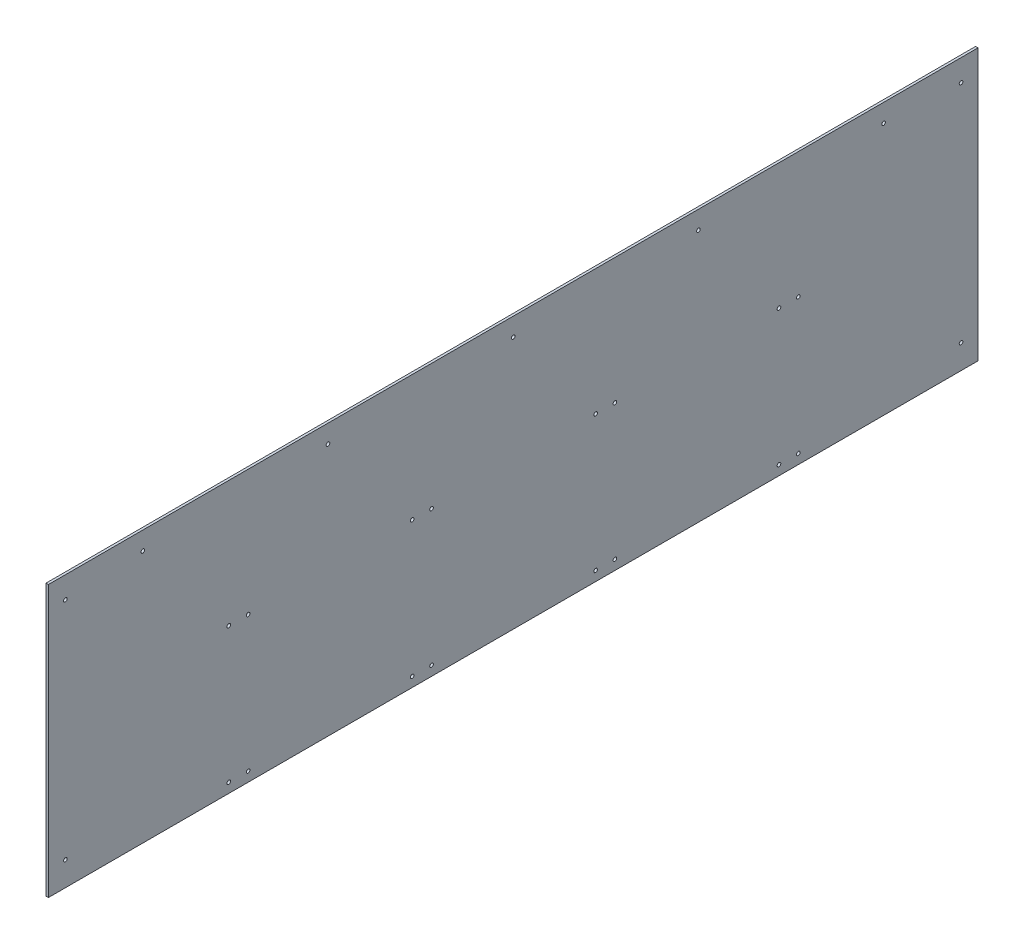
ISO-10303-21;
HEADER;
FILE_DESCRIPTION(('STEP AP214'),'2;1');
FILE_NAME('part.step','',(''),(''),'','','');
FILE_SCHEMA(('AUTOMOTIVE_DESIGN { 1 0 10303 214 1 1 1 1 }'));
ENDSEC;
DATA;
#1=APPLICATION_CONTEXT('core data for automotive mechanical design processes');
#2=APPLICATION_PROTOCOL_DEFINITION('international standard','automotive_design',2000,#1);
#3=PRODUCT_CONTEXT('',#1,'mechanical');
#4=PRODUCT('Part','Part','',(#3));
#5=PRODUCT_RELATED_PRODUCT_CATEGORY('part','',(#4));
#6=PRODUCT_DEFINITION_FORMATION('','',#4);
#7=PRODUCT_DEFINITION_CONTEXT('part definition',#1,'design');
#8=PRODUCT_DEFINITION('design','',#6,#7);
#9=PRODUCT_DEFINITION_SHAPE('','',#8);
#10=(LENGTH_UNIT() NAMED_UNIT(*) SI_UNIT(.MILLI.,.METRE.));
#11=(NAMED_UNIT(*) PLANE_ANGLE_UNIT() SI_UNIT($,.RADIAN.));
#12=(NAMED_UNIT(*) SI_UNIT($,.STERADIAN.) SOLID_ANGLE_UNIT());
#13=UNCERTAINTY_MEASURE_WITH_UNIT(LENGTH_MEASURE(1.E-05),#10,'distance_accuracy_value','');
#14=(GEOMETRIC_REPRESENTATION_CONTEXT(3) GLOBAL_UNCERTAINTY_ASSIGNED_CONTEXT((#13)) GLOBAL_UNIT_ASSIGNED_CONTEXT((#10,
#11,#12)) REPRESENTATION_CONTEXT('',''));
#15=CARTESIAN_POINT('',(0.,0.,0.));
#16=DIRECTION('',(0.,0.,1.));
#17=DIRECTION('',(1.,0.,0.));
#18=AXIS2_PLACEMENT_3D('',#15,#16,#17);
#19=CARTESIAN_POINT('',(0.,0.,0.));
#20=DIRECTION('',(-1.,0.,0.));
#21=DIRECTION('',(0.,0.,1.));
#22=AXIS2_PLACEMENT_3D('',#19,#20,#21);
#23=PLANE('',#22);
#24=CARTESIAN_POINT('',(0.,298.45,-1174.75));
#25=DIRECTION('',(1.,0.,0.));
#26=DIRECTION('',(0.,0.,-1.));
#27=AXIS2_PLACEMENT_3D('',#24,#25,#26);
#28=CIRCLE('',#27,4.7625);
#29=CARTESIAN_POINT('',(0.,298.45,-1179.5125));
#30=VERTEX_POINT('',#29);
#31=EDGE_CURVE('E198',#30,#30,#28,.T.);
#32=ORIENTED_EDGE('',*,*,#31,.T.);
#33=EDGE_LOOP('',(#32));
#34=FACE_BOUND('',#33,.T.);
#35=CARTESIAN_POINT('',(0.,-292.1,1174.75));
#36=DIRECTION('',(1.,0.,0.));
#37=DIRECTION('',(0.,0.,-1.));
#38=AXIS2_PLACEMENT_3D('',#35,#36,#37);
#39=CIRCLE('',#38,4.7625);
#40=CARTESIAN_POINT('',(0.,-292.1,1169.9875));
#41=VERTEX_POINT('',#40);
#42=EDGE_CURVE('E204',#41,#41,#39,.T.);
#43=ORIENTED_EDGE('',*,*,#42,.T.);
#44=EDGE_LOOP('',(#43));
#45=FACE_BOUND('',#44,.T.);
#46=CARTESIAN_POINT('',(0.,307.975,-971.55));
#47=DIRECTION('',(1.,0.,0.));
#48=DIRECTION('',(0.,0.,-1.));
#49=AXIS2_PLACEMENT_3D('',#46,#47,#48);
#50=CIRCLE('',#49,4.7625);
#51=CARTESIAN_POINT('',(0.,307.975,-976.3125));
#52=VERTEX_POINT('',#51);
#53=EDGE_CURVE('E41',#52,#52,#50,.T.);
#54=ORIENTED_EDGE('',*,*,#53,.T.);
#55=EDGE_LOOP('',(#54));
#56=FACE_BOUND('',#55,.T.);
#57=CARTESIAN_POINT('',(0.,307.975,-485.775));
#58=DIRECTION('',(1.,0.,0.));
#59=DIRECTION('',(0.,0.,-1.));
#60=AXIS2_PLACEMENT_3D('',#57,#58,#59);
#61=CIRCLE('',#60,4.7625);
#62=CARTESIAN_POINT('',(0.,307.975,-490.5375));
#63=VERTEX_POINT('',#62);
#64=EDGE_CURVE('E165',#63,#63,#61,.T.);
#65=ORIENTED_EDGE('',*,*,#64,.T.);
#66=EDGE_LOOP('',(#65));
#67=FACE_BOUND('',#66,.T.);
#68=CARTESIAN_POINT('',(0.,307.975,-1.11022302462516E-13));
#69=DIRECTION('',(1.,0.,0.));
#70=DIRECTION('',(0.,0.,-1.));
#71=AXIS2_PLACEMENT_3D('',#68,#69,#70);
#72=CIRCLE('',#71,4.7625);
#73=CARTESIAN_POINT('',(0.,307.975,-4.76250000000011));
#74=VERTEX_POINT('',#73);
#75=EDGE_CURVE('E159',#74,#74,#72,.T.);
#76=ORIENTED_EDGE('',*,*,#75,.T.);
#77=EDGE_LOOP('',(#76));
#78=FACE_BOUND('',#77,.T.);
#79=CARTESIAN_POINT('',(0.,25.4000000000001,-747.903));
#80=DIRECTION('',(1.,0.,0.));
#81=DIRECTION('',(0.,0.,-1.));
#82=AXIS2_PLACEMENT_3D('',#79,#80,#81);
#83=CIRCLE('',#82,4.7625);
#84=CARTESIAN_POINT('',(0.,25.4000000000001,-752.6655));
#85=VERTEX_POINT('',#84);
#86=EDGE_CURVE('E153',#85,#85,#83,.T.);
#87=ORIENTED_EDGE('',*,*,#86,.T.);
#88=EDGE_LOOP('',(#87));
#89=FACE_BOUND('',#88,.T.);
#90=CARTESIAN_POINT('',(0.,25.4000000000001,-266.827));
#91=DIRECTION('',(1.,0.,0.));
#92=DIRECTION('',(0.,0.,-1.));
#93=AXIS2_PLACEMENT_3D('',#90,#91,#92);
#94=CIRCLE('',#93,4.7625);
#95=CARTESIAN_POINT('',(0.,25.4000000000001,-271.5895));
#96=VERTEX_POINT('',#95);
#97=EDGE_CURVE('E147',#96,#96,#94,.T.);
#98=ORIENTED_EDGE('',*,*,#97,.T.);
#99=EDGE_LOOP('',(#98));
#100=FACE_BOUND('',#99,.T.);
#101=CARTESIAN_POINT('',(0.,-330.2,-697.103));
#102=DIRECTION('',(1.,0.,0.));
#103=DIRECTION('',(0.,0.,-1.));
#104=AXIS2_PLACEMENT_3D('',#101,#102,#103);
#105=CIRCLE('',#104,4.7625);
#106=CARTESIAN_POINT('',(0.,-330.2,-701.8655));
#107=VERTEX_POINT('',#106);
#108=EDGE_CURVE('E141',#107,#107,#105,.T.);
#109=ORIENTED_EDGE('',*,*,#108,.T.);
#110=EDGE_LOOP('',(#109));
#111=FACE_BOUND('',#110,.T.);
#112=CARTESIAN_POINT('',(0.,-330.2,-216.027));
#113=DIRECTION('',(1.,0.,0.));
#114=DIRECTION('',(0.,0.,-1.));
#115=AXIS2_PLACEMENT_3D('',#112,#113,#114);
#116=CIRCLE('',#115,4.7625);
#117=CARTESIAN_POINT('',(0.,-330.2,-220.7895));
#118=VERTEX_POINT('',#117);
#119=EDGE_CURVE('E135',#118,#118,#116,.T.);
#120=ORIENTED_EDGE('',*,*,#119,.T.);
#121=EDGE_LOOP('',(#120));
#122=FACE_BOUND('',#121,.T.);
#123=CARTESIAN_POINT('',(0.,-330.2,-747.903));
#124=DIRECTION('',(1.,0.,0.));
#125=DIRECTION('',(0.,0.,-1.));
#126=AXIS2_PLACEMENT_3D('',#123,#124,#125);
#127=CIRCLE('',#126,4.7625);
#128=CARTESIAN_POINT('',(0.,-330.2,-752.6655));
#129=VERTEX_POINT('',#128);
#130=EDGE_CURVE('E129',#129,#129,#127,.T.);
#131=ORIENTED_EDGE('',*,*,#130,.T.);
#132=EDGE_LOOP('',(#131));
#133=FACE_BOUND('',#132,.T.);
#134=CARTESIAN_POINT('',(0.,-330.2,-266.827));
#135=DIRECTION('',(1.,0.,0.));
#136=DIRECTION('',(0.,0.,-1.));
#137=AXIS2_PLACEMENT_3D('',#134,#135,#136);
#138=CIRCLE('',#137,4.7625);
#139=CARTESIAN_POINT('',(0.,-330.2,-271.5895));
#140=VERTEX_POINT('',#139);
#141=EDGE_CURVE('E123',#140,#140,#138,.T.);
#142=ORIENTED_EDGE('',*,*,#141,.T.);
#143=EDGE_LOOP('',(#142));
#144=FACE_BOUND('',#143,.T.);
#145=CARTESIAN_POINT('',(0.,25.4000000000001,-697.103));
#146=DIRECTION('',(1.,0.,0.));
#147=DIRECTION('',(0.,0.,-1.));
#148=AXIS2_PLACEMENT_3D('',#145,#146,#147);
#149=CIRCLE('',#148,4.7625);
#150=CARTESIAN_POINT('',(0.,25.4000000000001,-701.8655));
#151=VERTEX_POINT('',#150);
#152=EDGE_CURVE('E117',#151,#151,#149,.T.);
#153=ORIENTED_EDGE('',*,*,#152,.T.);
#154=EDGE_LOOP('',(#153));
#155=FACE_BOUND('',#154,.T.);
#156=CARTESIAN_POINT('',(0.,25.4000000000001,-216.027));
#157=DIRECTION('',(1.,0.,0.));
#158=DIRECTION('',(0.,0.,-1.));
#159=AXIS2_PLACEMENT_3D('',#156,#157,#158);
#160=CIRCLE('',#159,4.7625);
#161=CARTESIAN_POINT('',(0.,25.4000000000001,-220.7895));
#162=VERTEX_POINT('',#161);
#163=EDGE_CURVE('E111',#162,#162,#160,.T.);
#164=ORIENTED_EDGE('',*,*,#163,.T.);
#165=EDGE_LOOP('',(#164));
#166=FACE_BOUND('',#165,.T.);
#167=DIRECTION('',(0.,1.,0.));
#168=VECTOR('',#167,1.);
#169=CARTESIAN_POINT('',(0.,-355.6,-1219.2));
#170=LINE('',#169,#168);
#171=CARTESIAN_POINT('',(0.,-355.6,-1219.2));
#172=VERTEX_POINT('',#171);
#173=CARTESIAN_POINT('',(0.,355.6,-1219.2));
#174=VERTEX_POINT('',#173);
#175=EDGE_CURVE('E101',#172,#174,#170,.T.);
#176=ORIENTED_EDGE('',*,*,#175,.F.);
#177=DIRECTION('',(0.,0.,-1.));
#178=VECTOR('',#177,1.);
#179=CARTESIAN_POINT('',(0.,-355.6,1219.2));
#180=LINE('',#179,#178);
#181=CARTESIAN_POINT('',(0.,-355.6,1219.2));
#182=VERTEX_POINT('',#181);
#183=EDGE_CURVE('E72',#182,#172,#180,.T.);
#184=ORIENTED_EDGE('',*,*,#183,.F.);
#185=DIRECTION('',(0.,-1.,0.));
#186=VECTOR('',#185,1.);
#187=CARTESIAN_POINT('',(0.,-355.6,1219.2));
#188=LINE('',#187,#186);
#189=CARTESIAN_POINT('',(0.,355.6,1219.2));
#190=VERTEX_POINT('',#189);
#191=EDGE_CURVE('E66',#190,#182,#188,.T.);
#192=ORIENTED_EDGE('',*,*,#191,.F.);
#193=DIRECTION('',(0.,0.,1.));
#194=VECTOR('',#193,1.);
#195=CARTESIAN_POINT('',(0.,355.6,1219.2));
#196=LINE('',#195,#194);
#197=EDGE_CURVE('E91',#174,#190,#196,.T.);
#198=ORIENTED_EDGE('',*,*,#197,.F.);
#199=EDGE_LOOP('',(#176,#184,#192,#198));
#200=FACE_BOUND('',#199,.T.);
#201=CARTESIAN_POINT('',(0.,-330.2,695.325));
#202=DIRECTION('',(1.,0.,0.));
#203=DIRECTION('',(0.,0.,-1.));
#204=AXIS2_PLACEMENT_3D('',#201,#202,#203);
#205=CIRCLE('',#204,4.7625);
#206=CARTESIAN_POINT('',(0.,-330.2,690.5625));
#207=VERTEX_POINT('',#206);
#208=EDGE_CURVE('E104',#207,#207,#205,.T.);
#209=ORIENTED_EDGE('',*,*,#208,.T.);
#210=EDGE_LOOP('',(#209));
#211=FACE_BOUND('',#210,.T.);
#212=CARTESIAN_POINT('',(0.,-330.2,746.125));
#213=DIRECTION('',(1.,0.,0.));
#214=DIRECTION('',(0.,0.,-1.));
#215=AXIS2_PLACEMENT_3D('',#212,#213,#214);
#216=CIRCLE('',#215,4.7625);
#217=CARTESIAN_POINT('',(0.,-330.2,741.3625));
#218=VERTEX_POINT('',#217);
#219=EDGE_CURVE('E264',#218,#218,#216,.T.);
#220=ORIENTED_EDGE('',*,*,#219,.T.);
#221=EDGE_LOOP('',(#220));
#222=FACE_BOUND('',#221,.T.);
#223=CARTESIAN_POINT('',(0.,25.4000000000001,695.325));
#224=DIRECTION('',(1.,0.,0.));
#225=DIRECTION('',(0.,0.,-1.));
#226=AXIS2_PLACEMENT_3D('',#223,#224,#225);
#227=CIRCLE('',#226,4.7625);
#228=CARTESIAN_POINT('',(0.,25.4000000000001,690.5625));
#229=VERTEX_POINT('',#228);
#230=EDGE_CURVE('E258',#229,#229,#227,.T.);
#231=ORIENTED_EDGE('',*,*,#230,.T.);
#232=EDGE_LOOP('',(#231));
#233=FACE_BOUND('',#232,.T.);
#234=CARTESIAN_POINT('',(0.,25.4000000000001,746.125));
#235=DIRECTION('',(1.,0.,0.));
#236=DIRECTION('',(0.,0.,-1.));
#237=AXIS2_PLACEMENT_3D('',#234,#235,#236);
#238=CIRCLE('',#237,4.7625);
#239=CARTESIAN_POINT('',(0.,25.4000000000001,741.3625));
#240=VERTEX_POINT('',#239);
#241=EDGE_CURVE('E252',#240,#240,#238,.T.);
#242=ORIENTED_EDGE('',*,*,#241,.T.);
#243=EDGE_LOOP('',(#242));
#244=FACE_BOUND('',#243,.T.);
#245=CARTESIAN_POINT('',(0.,25.4000000000001,265.049));
#246=DIRECTION('',(1.,0.,0.));
#247=DIRECTION('',(0.,0.,-1.));
#248=AXIS2_PLACEMENT_3D('',#245,#246,#247);
#249=CIRCLE('',#248,4.7625);
#250=CARTESIAN_POINT('',(0.,25.4000000000001,260.2865));
#251=VERTEX_POINT('',#250);
#252=EDGE_CURVE('E243',#251,#251,#249,.T.);
#253=ORIENTED_EDGE('',*,*,#252,.T.);
#254=EDGE_LOOP('',(#253));
#255=FACE_BOUND('',#254,.T.);
#256=CARTESIAN_POINT('',(0.,-330.2,214.249));
#257=DIRECTION('',(1.,0.,0.));
#258=DIRECTION('',(0.,0.,-1.));
#259=AXIS2_PLACEMENT_3D('',#256,#257,#258);
#260=CIRCLE('',#259,4.7625);
#261=CARTESIAN_POINT('',(0.,-330.2,209.4865));
#262=VERTEX_POINT('',#261);
#263=EDGE_CURVE('E237',#262,#262,#260,.T.);
#264=ORIENTED_EDGE('',*,*,#263,.T.);
#265=EDGE_LOOP('',(#264));
#266=FACE_BOUND('',#265,.T.);
#267=CARTESIAN_POINT('',(0.,-330.2,265.049));
#268=DIRECTION('',(1.,0.,0.));
#269=DIRECTION('',(0.,0.,-1.));
#270=AXIS2_PLACEMENT_3D('',#267,#268,#269);
#271=CIRCLE('',#270,4.7625);
#272=CARTESIAN_POINT('',(0.,-330.2,260.2865));
#273=VERTEX_POINT('',#272);
#274=EDGE_CURVE('E231',#273,#273,#271,.T.);
#275=ORIENTED_EDGE('',*,*,#274,.T.);
#276=EDGE_LOOP('',(#275));
#277=FACE_BOUND('',#276,.T.);
#278=CARTESIAN_POINT('',(0.,25.4000000000001,214.249));
#279=DIRECTION('',(1.,0.,0.));
#280=DIRECTION('',(0.,0.,-1.));
#281=AXIS2_PLACEMENT_3D('',#278,#279,#280);
#282=CIRCLE('',#281,4.7625);
#283=CARTESIAN_POINT('',(0.,25.4000000000001,209.4865));
#284=VERTEX_POINT('',#283);
#285=EDGE_CURVE('E225',#284,#284,#282,.T.);
#286=ORIENTED_EDGE('',*,*,#285,.T.);
#287=EDGE_LOOP('',(#286));
#288=FACE_BOUND('',#287,.T.);
#289=CARTESIAN_POINT('',(0.,307.975,971.55));
#290=DIRECTION('',(1.,0.,0.));
#291=DIRECTION('',(0.,0.,-1.));
#292=AXIS2_PLACEMENT_3D('',#289,#290,#291);
#293=CIRCLE('',#292,4.7625);
#294=CARTESIAN_POINT('',(0.,307.975,966.7875));
#295=VERTEX_POINT('',#294);
#296=EDGE_CURVE('E222',#295,#295,#293,.T.);
#297=ORIENTED_EDGE('',*,*,#296,.T.);
#298=EDGE_LOOP('',(#297));
#299=FACE_BOUND('',#298,.T.);
#300=CARTESIAN_POINT('',(0.,307.975,485.775));
#301=DIRECTION('',(1.,0.,0.));
#302=DIRECTION('',(0.,0.,-1.));
#303=AXIS2_PLACEMENT_3D('',#300,#301,#302);
#304=CIRCLE('',#303,4.7625);
#305=CARTESIAN_POINT('',(0.,307.975,481.0125));
#306=VERTEX_POINT('',#305);
#307=EDGE_CURVE('E213',#306,#306,#304,.T.);
#308=ORIENTED_EDGE('',*,*,#307,.T.);
#309=EDGE_LOOP('',(#308));
#310=FACE_BOUND('',#309,.T.);
#311=CARTESIAN_POINT('',(0.,298.45,1174.75));
#312=DIRECTION('',(1.,0.,0.));
#313=DIRECTION('',(0.,0.,-1.));
#314=AXIS2_PLACEMENT_3D('',#311,#312,#313);
#315=CIRCLE('',#314,4.7625);
#316=CARTESIAN_POINT('',(0.,298.45,1169.9875));
#317=VERTEX_POINT('',#316);
#318=EDGE_CURVE('E210',#317,#317,#315,.T.);
#319=ORIENTED_EDGE('',*,*,#318,.T.);
#320=EDGE_LOOP('',(#319));
#321=FACE_BOUND('',#320,.T.);
#322=CARTESIAN_POINT('',(0.,-292.1,-1174.75));
#323=DIRECTION('',(1.,0.,0.));
#324=DIRECTION('',(0.,0.,-1.));
#325=AXIS2_PLACEMENT_3D('',#322,#323,#324);
#326=CIRCLE('',#325,4.7625);
#327=CARTESIAN_POINT('',(0.,-292.1,-1179.5125));
#328=VERTEX_POINT('',#327);
#329=EDGE_CURVE('E192',#328,#328,#326,.T.);
#330=ORIENTED_EDGE('',*,*,#329,.T.);
#331=EDGE_LOOP('',(#330));
#332=FACE_BOUND('',#331,.T.);
#333=ADVANCED_FACE('F32',(#34,#45,#56,#67,#78,#89,#100,#111,#122,#133,#144,#155,#166,#200,#211,
#222,#233,#244,#255,#266,#277,#288,#299,#310,#321,#332),#23,.T.);
#334=CARTESIAN_POINT('',(6.35,0.,0.));
#335=DIRECTION('',(-1.,0.,0.));
#336=DIRECTION('',(0.,0.,1.));
#337=AXIS2_PLACEMENT_3D('',#334,#335,#336);
#338=PLANE('',#337);
#339=CARTESIAN_POINT('',(6.35,-292.1,1174.75));
#340=DIRECTION('',(1.,0.,0.));
#341=DIRECTION('',(0.,0.,-1.));
#342=AXIS2_PLACEMENT_3D('',#339,#340,#341);
#343=CIRCLE('',#342,4.7625);
#344=CARTESIAN_POINT('',(6.35,-292.1,1169.9875));
#345=VERTEX_POINT('',#344);
#346=EDGE_CURVE('E201',#345,#345,#343,.T.);
#347=ORIENTED_EDGE('',*,*,#346,.F.);
#348=EDGE_LOOP('',(#347));
#349=FACE_BOUND('',#348,.T.);
#350=CARTESIAN_POINT('',(6.35,298.45,1174.75));
#351=DIRECTION('',(1.,0.,0.));
#352=DIRECTION('',(0.,0.,-1.));
#353=AXIS2_PLACEMENT_3D('',#350,#351,#352);
#354=CIRCLE('',#353,4.7625);
#355=CARTESIAN_POINT('',(6.35,298.45,1169.9875));
#356=VERTEX_POINT('',#355);
#357=EDGE_CURVE('E207',#356,#356,#354,.T.);
#358=ORIENTED_EDGE('',*,*,#357,.F.);
#359=EDGE_LOOP('',(#358));
#360=FACE_BOUND('',#359,.T.);
#361=CARTESIAN_POINT('',(6.35,307.975,485.775));
#362=DIRECTION('',(1.,0.,0.));
#363=DIRECTION('',(0.,0.,-1.));
#364=AXIS2_PLACEMENT_3D('',#361,#362,#363);
#365=CIRCLE('',#364,4.7625);
#366=CARTESIAN_POINT('',(6.35,307.975,481.0125));
#367=VERTEX_POINT('',#366);
#368=EDGE_CURVE('E216',#367,#367,#365,.T.);
#369=ORIENTED_EDGE('',*,*,#368,.F.);
#370=EDGE_LOOP('',(#369));
#371=FACE_BOUND('',#370,.T.);
#372=CARTESIAN_POINT('',(6.35,307.975,971.55));
#373=DIRECTION('',(1.,0.,0.));
#374=DIRECTION('',(0.,0.,-1.));
#375=AXIS2_PLACEMENT_3D('',#372,#373,#374);
#376=CIRCLE('',#375,4.7625);
#377=CARTESIAN_POINT('',(6.35,307.975,966.7875));
#378=VERTEX_POINT('',#377);
#379=EDGE_CURVE('E219',#378,#378,#376,.T.);
#380=ORIENTED_EDGE('',*,*,#379,.F.);
#381=EDGE_LOOP('',(#380));
#382=FACE_BOUND('',#381,.T.);
#383=CARTESIAN_POINT('',(6.35,25.4000000000001,214.249));
#384=DIRECTION('',(1.,0.,0.));
#385=DIRECTION('',(0.,0.,-1.));
#386=AXIS2_PLACEMENT_3D('',#383,#384,#385);
#387=CIRCLE('',#386,4.7625);
#388=CARTESIAN_POINT('',(6.35,25.4000000000001,209.4865));
#389=VERTEX_POINT('',#388);
#390=EDGE_CURVE('E228',#389,#389,#387,.T.);
#391=ORIENTED_EDGE('',*,*,#390,.F.);
#392=EDGE_LOOP('',(#391));
#393=FACE_BOUND('',#392,.T.);
#394=CARTESIAN_POINT('',(6.35,-330.2,265.049));
#395=DIRECTION('',(1.,0.,0.));
#396=DIRECTION('',(0.,0.,-1.));
#397=AXIS2_PLACEMENT_3D('',#394,#395,#396);
#398=CIRCLE('',#397,4.7625);
#399=CARTESIAN_POINT('',(6.35,-330.2,260.2865));
#400=VERTEX_POINT('',#399);
#401=EDGE_CURVE('E234',#400,#400,#398,.T.);
#402=ORIENTED_EDGE('',*,*,#401,.F.);
#403=EDGE_LOOP('',(#402));
#404=FACE_BOUND('',#403,.T.);
#405=CARTESIAN_POINT('',(6.35,-330.2,214.249));
#406=DIRECTION('',(1.,0.,0.));
#407=DIRECTION('',(0.,0.,-1.));
#408=AXIS2_PLACEMENT_3D('',#405,#406,#407);
#409=CIRCLE('',#408,4.7625);
#410=CARTESIAN_POINT('',(6.35,-330.2,209.4865));
#411=VERTEX_POINT('',#410);
#412=EDGE_CURVE('E240',#411,#411,#409,.T.);
#413=ORIENTED_EDGE('',*,*,#412,.F.);
#414=EDGE_LOOP('',(#413));
#415=FACE_BOUND('',#414,.T.);
#416=CARTESIAN_POINT('',(6.35,25.4000000000001,265.049));
#417=DIRECTION('',(1.,0.,0.));
#418=DIRECTION('',(0.,0.,-1.));
#419=AXIS2_PLACEMENT_3D('',#416,#417,#418);
#420=CIRCLE('',#419,4.7625);
#421=CARTESIAN_POINT('',(6.35,25.4000000000001,260.2865));
#422=VERTEX_POINT('',#421);
#423=EDGE_CURVE('E246',#422,#422,#420,.T.);
#424=ORIENTED_EDGE('',*,*,#423,.F.);
#425=EDGE_LOOP('',(#424));
#426=FACE_BOUND('',#425,.T.);
#427=CARTESIAN_POINT('',(6.35,25.4000000000001,746.125));
#428=DIRECTION('',(1.,0.,0.));
#429=DIRECTION('',(0.,0.,-1.));
#430=AXIS2_PLACEMENT_3D('',#427,#428,#429);
#431=CIRCLE('',#430,4.7625);
#432=CARTESIAN_POINT('',(6.35,25.4000000000001,741.3625));
#433=VERTEX_POINT('',#432);
#434=EDGE_CURVE('E249',#433,#433,#431,.T.);
#435=ORIENTED_EDGE('',*,*,#434,.F.);
#436=EDGE_LOOP('',(#435));
#437=FACE_BOUND('',#436,.T.);
#438=CARTESIAN_POINT('',(6.35,25.4000000000001,695.325));
#439=DIRECTION('',(1.,0.,0.));
#440=DIRECTION('',(0.,0.,-1.));
#441=AXIS2_PLACEMENT_3D('',#438,#439,#440);
#442=CIRCLE('',#441,4.7625);
#443=CARTESIAN_POINT('',(6.35,25.4000000000001,690.5625));
#444=VERTEX_POINT('',#443);
#445=EDGE_CURVE('E255',#444,#444,#442,.T.);
#446=ORIENTED_EDGE('',*,*,#445,.F.);
#447=EDGE_LOOP('',(#446));
#448=FACE_BOUND('',#447,.T.);
#449=CARTESIAN_POINT('',(6.35,-330.2,746.125));
#450=DIRECTION('',(1.,0.,0.));
#451=DIRECTION('',(0.,0.,-1.));
#452=AXIS2_PLACEMENT_3D('',#449,#450,#451);
#453=CIRCLE('',#452,4.7625);
#454=CARTESIAN_POINT('',(6.35,-330.2,741.3625));
#455=VERTEX_POINT('',#454);
#456=EDGE_CURVE('E261',#455,#455,#453,.T.);
#457=ORIENTED_EDGE('',*,*,#456,.F.);
#458=EDGE_LOOP('',(#457));
#459=FACE_BOUND('',#458,.T.);
#460=CARTESIAN_POINT('',(6.35,-330.2,695.325));
#461=DIRECTION('',(1.,0.,0.));
#462=DIRECTION('',(0.,0.,-1.));
#463=AXIS2_PLACEMENT_3D('',#460,#461,#462);
#464=CIRCLE('',#463,4.7625);
#465=CARTESIAN_POINT('',(6.35,-330.2,690.5625));
#466=VERTEX_POINT('',#465);
#467=EDGE_CURVE('E267',#466,#466,#464,.T.);
#468=ORIENTED_EDGE('',*,*,#467,.F.);
#469=EDGE_LOOP('',(#468));
#470=FACE_BOUND('',#469,.T.);
#471=DIRECTION('',(0.,1.,0.));
#472=VECTOR('',#471,1.);
#473=CARTESIAN_POINT('',(6.35,-355.6,-1219.2));
#474=LINE('',#473,#472);
#475=CARTESIAN_POINT('',(6.35,-355.6,-1219.2));
#476=VERTEX_POINT('',#475);
#477=CARTESIAN_POINT('',(6.35,355.6,-1219.2));
#478=VERTEX_POINT('',#477);
#479=EDGE_CURVE('E86',#476,#478,#474,.T.);
#480=ORIENTED_EDGE('',*,*,#479,.T.);
#481=DIRECTION('',(0.,0.,1.));
#482=VECTOR('',#481,1.);
#483=CARTESIAN_POINT('',(6.35,355.6,1219.2));
#484=LINE('',#483,#482);
#485=CARTESIAN_POINT('',(6.35,355.6,1219.2));
#486=VERTEX_POINT('',#485);
#487=EDGE_CURVE('E80',#478,#486,#484,.T.);
#488=ORIENTED_EDGE('',*,*,#487,.T.);
#489=DIRECTION('',(0.,-1.,0.));
#490=VECTOR('',#489,1.);
#491=CARTESIAN_POINT('',(6.35,-355.6,1219.2));
#492=LINE('',#491,#490);
#493=CARTESIAN_POINT('',(6.35,-355.6,1219.2));
#494=VERTEX_POINT('',#493);
#495=EDGE_CURVE('E84',#486,#494,#492,.T.);
#496=ORIENTED_EDGE('',*,*,#495,.T.);
#497=DIRECTION('',(0.,0.,-1.));
#498=VECTOR('',#497,1.);
#499=CARTESIAN_POINT('',(6.35,-355.6,1219.2));
#500=LINE('',#499,#498);
#501=EDGE_CURVE('E49',#494,#476,#500,.T.);
#502=ORIENTED_EDGE('',*,*,#501,.T.);
#503=EDGE_LOOP('',(#480,#488,#496,#502));
#504=FACE_BOUND('',#503,.T.);
#505=CARTESIAN_POINT('',(6.35,25.4000000000001,-216.027));
#506=DIRECTION('',(1.,0.,0.));
#507=DIRECTION('',(0.,0.,-1.));
#508=AXIS2_PLACEMENT_3D('',#505,#506,#507);
#509=CIRCLE('',#508,4.7625);
#510=CARTESIAN_POINT('',(6.35,25.4000000000001,-220.7895));
#511=VERTEX_POINT('',#510);
#512=EDGE_CURVE('E114',#511,#511,#509,.T.);
#513=ORIENTED_EDGE('',*,*,#512,.F.);
#514=EDGE_LOOP('',(#513));
#515=FACE_BOUND('',#514,.T.);
#516=CARTESIAN_POINT('',(6.35,25.4000000000001,-697.103));
#517=DIRECTION('',(1.,0.,0.));
#518=DIRECTION('',(0.,0.,-1.));
#519=AXIS2_PLACEMENT_3D('',#516,#517,#518);
#520=CIRCLE('',#519,4.7625);
#521=CARTESIAN_POINT('',(6.35,25.4000000000001,-701.8655));
#522=VERTEX_POINT('',#521);
#523=EDGE_CURVE('E120',#522,#522,#520,.T.);
#524=ORIENTED_EDGE('',*,*,#523,.F.);
#525=EDGE_LOOP('',(#524));
#526=FACE_BOUND('',#525,.T.);
#527=CARTESIAN_POINT('',(6.35,-330.2,-266.827));
#528=DIRECTION('',(1.,0.,0.));
#529=DIRECTION('',(0.,0.,-1.));
#530=AXIS2_PLACEMENT_3D('',#527,#528,#529);
#531=CIRCLE('',#530,4.7625);
#532=CARTESIAN_POINT('',(6.35,-330.2,-271.5895));
#533=VERTEX_POINT('',#532);
#534=EDGE_CURVE('E126',#533,#533,#531,.T.);
#535=ORIENTED_EDGE('',*,*,#534,.F.);
#536=EDGE_LOOP('',(#535));
#537=FACE_BOUND('',#536,.T.);
#538=CARTESIAN_POINT('',(6.35,-330.2,-747.903));
#539=DIRECTION('',(1.,0.,0.));
#540=DIRECTION('',(0.,0.,-1.));
#541=AXIS2_PLACEMENT_3D('',#538,#539,#540);
#542=CIRCLE('',#541,4.7625);
#543=CARTESIAN_POINT('',(6.35,-330.2,-752.6655));
#544=VERTEX_POINT('',#543);
#545=EDGE_CURVE('E132',#544,#544,#542,.T.);
#546=ORIENTED_EDGE('',*,*,#545,.F.);
#547=EDGE_LOOP('',(#546));
#548=FACE_BOUND('',#547,.T.);
#549=CARTESIAN_POINT('',(6.35,-330.2,-216.027));
#550=DIRECTION('',(1.,0.,0.));
#551=DIRECTION('',(0.,0.,-1.));
#552=AXIS2_PLACEMENT_3D('',#549,#550,#551);
#553=CIRCLE('',#552,4.7625);
#554=CARTESIAN_POINT('',(6.35,-330.2,-220.7895));
#555=VERTEX_POINT('',#554);
#556=EDGE_CURVE('E138',#555,#555,#553,.T.);
#557=ORIENTED_EDGE('',*,*,#556,.F.);
#558=EDGE_LOOP('',(#557));
#559=FACE_BOUND('',#558,.T.);
#560=CARTESIAN_POINT('',(6.35,-330.2,-697.103));
#561=DIRECTION('',(1.,0.,0.));
#562=DIRECTION('',(0.,0.,-1.));
#563=AXIS2_PLACEMENT_3D('',#560,#561,#562);
#564=CIRCLE('',#563,4.7625);
#565=CARTESIAN_POINT('',(6.35,-330.2,-701.8655));
#566=VERTEX_POINT('',#565);
#567=EDGE_CURVE('E144',#566,#566,#564,.T.);
#568=ORIENTED_EDGE('',*,*,#567,.F.);
#569=EDGE_LOOP('',(#568));
#570=FACE_BOUND('',#569,.T.);
#571=CARTESIAN_POINT('',(6.35,25.4000000000001,-266.827));
#572=DIRECTION('',(1.,0.,0.));
#573=DIRECTION('',(0.,0.,-1.));
#574=AXIS2_PLACEMENT_3D('',#571,#572,#573);
#575=CIRCLE('',#574,4.7625);
#576=CARTESIAN_POINT('',(6.35,25.4000000000001,-271.5895));
#577=VERTEX_POINT('',#576);
#578=EDGE_CURVE('E150',#577,#577,#575,.T.);
#579=ORIENTED_EDGE('',*,*,#578,.F.);
#580=EDGE_LOOP('',(#579));
#581=FACE_BOUND('',#580,.T.);
#582=CARTESIAN_POINT('',(6.35,25.4000000000001,-747.903));
#583=DIRECTION('',(1.,0.,0.));
#584=DIRECTION('',(0.,0.,-1.));
#585=AXIS2_PLACEMENT_3D('',#582,#583,#584);
#586=CIRCLE('',#585,4.7625);
#587=CARTESIAN_POINT('',(6.35,25.4000000000001,-752.6655));
#588=VERTEX_POINT('',#587);
#589=EDGE_CURVE('E156',#588,#588,#586,.T.);
#590=ORIENTED_EDGE('',*,*,#589,.F.);
#591=EDGE_LOOP('',(#590));
#592=FACE_BOUND('',#591,.T.);
#593=CARTESIAN_POINT('',(6.35,307.975,-1.11022302462516E-13));
#594=DIRECTION('',(1.,0.,0.));
#595=DIRECTION('',(0.,0.,-1.));
#596=AXIS2_PLACEMENT_3D('',#593,#594,#595);
#597=CIRCLE('',#596,4.7625);
#598=CARTESIAN_POINT('',(6.35,307.975,-4.76250000000011));
#599=VERTEX_POINT('',#598);
#600=EDGE_CURVE('E162',#599,#599,#597,.T.);
#601=ORIENTED_EDGE('',*,*,#600,.F.);
#602=EDGE_LOOP('',(#601));
#603=FACE_BOUND('',#602,.T.);
#604=CARTESIAN_POINT('',(6.35,307.975,-485.775));
#605=DIRECTION('',(1.,0.,0.));
#606=DIRECTION('',(0.,0.,-1.));
#607=AXIS2_PLACEMENT_3D('',#604,#605,#606);
#608=CIRCLE('',#607,4.7625);
#609=CARTESIAN_POINT('',(6.35,307.975,-490.5375));
#610=VERTEX_POINT('',#609);
#611=EDGE_CURVE('E168',#610,#610,#608,.T.);
#612=ORIENTED_EDGE('',*,*,#611,.F.);
#613=EDGE_LOOP('',(#612));
#614=FACE_BOUND('',#613,.T.);
#615=CARTESIAN_POINT('',(6.35,307.975,-971.55));
#616=DIRECTION('',(1.,0.,0.));
#617=DIRECTION('',(0.,0.,-1.));
#618=AXIS2_PLACEMENT_3D('',#615,#616,#617);
#619=CIRCLE('',#618,4.7625);
#620=CARTESIAN_POINT('',(6.35,307.975,-976.3125));
#621=VERTEX_POINT('',#620);
#622=EDGE_CURVE('E11',#621,#621,#619,.T.);
#623=ORIENTED_EDGE('',*,*,#622,.F.);
#624=EDGE_LOOP('',(#623));
#625=FACE_BOUND('',#624,.T.);
#626=CARTESIAN_POINT('',(6.35,298.45,-1174.75));
#627=DIRECTION('',(1.,0.,0.));
#628=DIRECTION('',(0.,0.,-1.));
#629=AXIS2_PLACEMENT_3D('',#626,#627,#628);
#630=CIRCLE('',#629,4.7625);
#631=CARTESIAN_POINT('',(6.35,298.45,-1179.5125));
#632=VERTEX_POINT('',#631);
#633=EDGE_CURVE('E187',#632,#632,#630,.T.);
#634=ORIENTED_EDGE('',*,*,#633,.F.);
#635=EDGE_LOOP('',(#634));
#636=FACE_BOUND('',#635,.T.);
#637=CARTESIAN_POINT('',(6.35,-292.1,-1174.75));
#638=DIRECTION('',(1.,0.,0.));
#639=DIRECTION('',(0.,0.,-1.));
#640=AXIS2_PLACEMENT_3D('',#637,#638,#639);
#641=CIRCLE('',#640,4.7625);
#642=CARTESIAN_POINT('',(6.35,-292.1,-1179.5125));
#643=VERTEX_POINT('',#642);
#644=EDGE_CURVE('E190',#643,#643,#641,.T.);
#645=ORIENTED_EDGE('',*,*,#644,.F.);
#646=EDGE_LOOP('',(#645));
#647=FACE_BOUND('',#646,.T.);
#648=ADVANCED_FACE('F81',(#349,#360,#371,#382,#393,#404,#415,#426,#437,#448,#459,#470,#504,#515,
#526,#537,#548,#559,#570,#581,#592,#603,#614,#625,#636,#647),#338,.F.);
#649=CARTESIAN_POINT('',(6.35,307.975,-971.55));
#650=DIRECTION('',(1.,0.,0.));
#651=DIRECTION('',(0.,0.,-1.));
#652=AXIS2_PLACEMENT_3D('',#649,#650,#651);
#653=CYLINDRICAL_SURFACE('',#652,4.7625);
#654=ORIENTED_EDGE('',*,*,#53,.F.);
#655=EDGE_LOOP('',(#654));
#656=FACE_BOUND('',#655,.T.);
#657=ORIENTED_EDGE('',*,*,#622,.T.);
#658=EDGE_LOOP('',(#657));
#659=FACE_BOUND('',#658,.T.);
#660=ADVANCED_FACE('F34',(#656,#659),#653,.F.);
#661=CARTESIAN_POINT('',(6.35,307.975,-485.775));
#662=DIRECTION('',(1.,0.,0.));
#663=DIRECTION('',(0.,0.,-1.));
#664=AXIS2_PLACEMENT_3D('',#661,#662,#663);
#665=CYLINDRICAL_SURFACE('',#664,4.7625);
#666=ORIENTED_EDGE('',*,*,#64,.F.);
#667=EDGE_LOOP('',(#666));
#668=FACE_BOUND('',#667,.T.);
#669=ORIENTED_EDGE('',*,*,#611,.T.);
#670=EDGE_LOOP('',(#669));
#671=FACE_BOUND('',#670,.T.);
#672=ADVANCED_FACE('F177',(#668,#671),#665,.F.);
#673=CARTESIAN_POINT('',(6.35,307.975,-1.11022302462516E-13));
#674=DIRECTION('',(1.,0.,0.));
#675=DIRECTION('',(0.,0.,-1.));
#676=AXIS2_PLACEMENT_3D('',#673,#674,#675);
#677=CYLINDRICAL_SURFACE('',#676,4.7625);
#678=ORIENTED_EDGE('',*,*,#75,.F.);
#679=EDGE_LOOP('',(#678));
#680=FACE_BOUND('',#679,.T.);
#681=ORIENTED_EDGE('',*,*,#600,.T.);
#682=EDGE_LOOP('',(#681));
#683=FACE_BOUND('',#682,.T.);
#684=ADVANCED_FACE('F337',(#680,#683),#677,.F.);
#685=CARTESIAN_POINT('',(6.35,25.4000000000001,-747.903));
#686=DIRECTION('',(1.,0.,0.));
#687=DIRECTION('',(0.,0.,-1.));
#688=AXIS2_PLACEMENT_3D('',#685,#686,#687);
#689=CYLINDRICAL_SURFACE('',#688,4.7625);
#690=ORIENTED_EDGE('',*,*,#86,.F.);
#691=EDGE_LOOP('',(#690));
#692=FACE_BOUND('',#691,.T.);
#693=ORIENTED_EDGE('',*,*,#589,.T.);
#694=EDGE_LOOP('',(#693));
#695=FACE_BOUND('',#694,.T.);
#696=ADVANCED_FACE('F333',(#692,#695),#689,.F.);
#697=CARTESIAN_POINT('',(6.35,25.4000000000001,-266.827));
#698=DIRECTION('',(1.,0.,0.));
#699=DIRECTION('',(0.,0.,-1.));
#700=AXIS2_PLACEMENT_3D('',#697,#698,#699);
#701=CYLINDRICAL_SURFACE('',#700,4.7625);
#702=ORIENTED_EDGE('',*,*,#97,.F.);
#703=EDGE_LOOP('',(#702));
#704=FACE_BOUND('',#703,.T.);
#705=ORIENTED_EDGE('',*,*,#578,.T.);
#706=EDGE_LOOP('',(#705));
#707=FACE_BOUND('',#706,.T.);
#708=ADVANCED_FACE('F329',(#704,#707),#701,.F.);
#709=CARTESIAN_POINT('',(6.35,-330.2,-697.103));
#710=DIRECTION('',(1.,0.,0.));
#711=DIRECTION('',(0.,0.,-1.));
#712=AXIS2_PLACEMENT_3D('',#709,#710,#711);
#713=CYLINDRICAL_SURFACE('',#712,4.7625);
#714=ORIENTED_EDGE('',*,*,#108,.F.);
#715=EDGE_LOOP('',(#714));
#716=FACE_BOUND('',#715,.T.);
#717=ORIENTED_EDGE('',*,*,#567,.T.);
#718=EDGE_LOOP('',(#717));
#719=FACE_BOUND('',#718,.T.);
#720=ADVANCED_FACE('F325',(#716,#719),#713,.F.);
#721=CARTESIAN_POINT('',(6.35,-330.2,-216.027));
#722=DIRECTION('',(1.,0.,0.));
#723=DIRECTION('',(0.,0.,-1.));
#724=AXIS2_PLACEMENT_3D('',#721,#722,#723);
#725=CYLINDRICAL_SURFACE('',#724,4.7625);
#726=ORIENTED_EDGE('',*,*,#119,.F.);
#727=EDGE_LOOP('',(#726));
#728=FACE_BOUND('',#727,.T.);
#729=ORIENTED_EDGE('',*,*,#556,.T.);
#730=EDGE_LOOP('',(#729));
#731=FACE_BOUND('',#730,.T.);
#732=ADVANCED_FACE('F321',(#728,#731),#725,.F.);
#733=CARTESIAN_POINT('',(6.35,-330.2,-747.903));
#734=DIRECTION('',(1.,0.,0.));
#735=DIRECTION('',(0.,0.,-1.));
#736=AXIS2_PLACEMENT_3D('',#733,#734,#735);
#737=CYLINDRICAL_SURFACE('',#736,4.7625);
#738=ORIENTED_EDGE('',*,*,#130,.F.);
#739=EDGE_LOOP('',(#738));
#740=FACE_BOUND('',#739,.T.);
#741=ORIENTED_EDGE('',*,*,#545,.T.);
#742=EDGE_LOOP('',(#741));
#743=FACE_BOUND('',#742,.T.);
#744=ADVANCED_FACE('F317',(#740,#743),#737,.F.);
#745=CARTESIAN_POINT('',(6.35,-330.2,-266.827));
#746=DIRECTION('',(1.,0.,0.));
#747=DIRECTION('',(0.,0.,-1.));
#748=AXIS2_PLACEMENT_3D('',#745,#746,#747);
#749=CYLINDRICAL_SURFACE('',#748,4.7625);
#750=ORIENTED_EDGE('',*,*,#141,.F.);
#751=EDGE_LOOP('',(#750));
#752=FACE_BOUND('',#751,.T.);
#753=ORIENTED_EDGE('',*,*,#534,.T.);
#754=EDGE_LOOP('',(#753));
#755=FACE_BOUND('',#754,.T.);
#756=ADVANCED_FACE('F313',(#752,#755),#749,.F.);
#757=CARTESIAN_POINT('',(6.35,25.4000000000001,-697.103));
#758=DIRECTION('',(1.,0.,0.));
#759=DIRECTION('',(0.,0.,-1.));
#760=AXIS2_PLACEMENT_3D('',#757,#758,#759);
#761=CYLINDRICAL_SURFACE('',#760,4.7625);
#762=ORIENTED_EDGE('',*,*,#152,.F.);
#763=EDGE_LOOP('',(#762));
#764=FACE_BOUND('',#763,.T.);
#765=ORIENTED_EDGE('',*,*,#523,.T.);
#766=EDGE_LOOP('',(#765));
#767=FACE_BOUND('',#766,.T.);
#768=ADVANCED_FACE('F309',(#764,#767),#761,.F.);
#769=CARTESIAN_POINT('',(6.35,25.4000000000001,-216.027));
#770=DIRECTION('',(1.,0.,0.));
#771=DIRECTION('',(0.,0.,-1.));
#772=AXIS2_PLACEMENT_3D('',#769,#770,#771);
#773=CYLINDRICAL_SURFACE('',#772,4.7625);
#774=ORIENTED_EDGE('',*,*,#163,.F.);
#775=EDGE_LOOP('',(#774));
#776=FACE_BOUND('',#775,.T.);
#777=ORIENTED_EDGE('',*,*,#512,.T.);
#778=EDGE_LOOP('',(#777));
#779=FACE_BOUND('',#778,.T.);
#780=ADVANCED_FACE('F305',(#776,#779),#773,.F.);
#781=CARTESIAN_POINT('',(6.35,-355.6,-1219.2));
#782=DIRECTION('',(0.,0.,1.));
#783=DIRECTION('',(1.,0.,0.));
#784=AXIS2_PLACEMENT_3D('',#781,#782,#783);
#785=PLANE('',#784);
#786=ORIENTED_EDGE('',*,*,#175,.T.);
#787=DIRECTION('',(-1.,0.,0.));
#788=VECTOR('',#787,1.);
#789=CARTESIAN_POINT('',(6.35,355.6,-1219.2));
#790=LINE('',#789,#788);
#791=EDGE_CURVE('E92',#478,#174,#790,.T.);
#792=ORIENTED_EDGE('',*,*,#791,.F.);
#793=ORIENTED_EDGE('',*,*,#479,.F.);
#794=DIRECTION('',(-1.,0.,0.));
#795=VECTOR('',#794,1.);
#796=CARTESIAN_POINT('',(6.35,-355.6,-1219.2));
#797=LINE('',#796,#795);
#798=EDGE_CURVE('E97',#476,#172,#797,.T.);
#799=ORIENTED_EDGE('',*,*,#798,.T.);
#800=EDGE_LOOP('',(#786,#792,#793,#799));
#801=FACE_BOUND('',#800,.T.);
#802=ADVANCED_FACE('F302',(#801),#785,.F.);
#803=CARTESIAN_POINT('',(6.35,355.6,1219.2));
#804=DIRECTION('',(0.,-1.,0.));
#805=DIRECTION('',(0.,0.,-1.));
#806=AXIS2_PLACEMENT_3D('',#803,#804,#805);
#807=PLANE('',#806);
#808=ORIENTED_EDGE('',*,*,#197,.T.);
#809=DIRECTION('',(-1.,0.,0.));
#810=VECTOR('',#809,1.);
#811=CARTESIAN_POINT('',(6.35,355.6,1219.2));
#812=LINE('',#811,#810);
#813=EDGE_CURVE('E89',#486,#190,#812,.T.);
#814=ORIENTED_EDGE('',*,*,#813,.F.);
#815=ORIENTED_EDGE('',*,*,#487,.F.);
#816=ORIENTED_EDGE('',*,*,#791,.T.);
#817=EDGE_LOOP('',(#808,#814,#815,#816));
#818=FACE_BOUND('',#817,.T.);
#819=ADVANCED_FACE('F90',(#818),#807,.F.);
#820=CARTESIAN_POINT('',(6.35,-355.6,1219.2));
#821=DIRECTION('',(0.,0.,-1.));
#822=DIRECTION('',(-1.,0.,0.));
#823=AXIS2_PLACEMENT_3D('',#820,#821,#822);
#824=PLANE('',#823);
#825=ORIENTED_EDGE('',*,*,#191,.T.);
#826=DIRECTION('',(-1.,0.,0.));
#827=VECTOR('',#826,1.);
#828=CARTESIAN_POINT('',(6.35,-355.6,1219.2));
#829=LINE('',#828,#827);
#830=EDGE_CURVE('E93',#494,#182,#829,.T.);
#831=ORIENTED_EDGE('',*,*,#830,.F.);
#832=ORIENTED_EDGE('',*,*,#495,.F.);
#833=ORIENTED_EDGE('',*,*,#813,.T.);
#834=EDGE_LOOP('',(#825,#831,#832,#833));
#835=FACE_BOUND('',#834,.T.);
#836=ADVANCED_FACE('F95',(#835),#824,.F.);
#837=CARTESIAN_POINT('',(6.35,-355.6,1219.2));
#838=DIRECTION('',(0.,1.,0.));
#839=DIRECTION('',(0.,0.,1.));
#840=AXIS2_PLACEMENT_3D('',#837,#838,#839);
#841=PLANE('',#840);
#842=ORIENTED_EDGE('',*,*,#183,.T.);
#843=ORIENTED_EDGE('',*,*,#798,.F.);
#844=ORIENTED_EDGE('',*,*,#501,.F.);
#845=ORIENTED_EDGE('',*,*,#830,.T.);
#846=EDGE_LOOP('',(#842,#843,#844,#845));
#847=FACE_BOUND('',#846,.T.);
#848=ADVANCED_FACE('F279',(#847),#841,.F.);
#849=CARTESIAN_POINT('',(6.35,-330.2,695.325));
#850=DIRECTION('',(1.,0.,0.));
#851=DIRECTION('',(0.,0.,-1.));
#852=AXIS2_PLACEMENT_3D('',#849,#850,#851);
#853=CYLINDRICAL_SURFACE('',#852,4.7625);
#854=ORIENTED_EDGE('',*,*,#208,.F.);
#855=EDGE_LOOP('',(#854));
#856=FACE_BOUND('',#855,.T.);
#857=ORIENTED_EDGE('',*,*,#467,.T.);
#858=EDGE_LOOP('',(#857));
#859=FACE_BOUND('',#858,.T.);
#860=ADVANCED_FACE('F275',(#856,#859),#853,.F.);
#861=CARTESIAN_POINT('',(6.35,-330.2,746.125));
#862=DIRECTION('',(1.,0.,0.));
#863=DIRECTION('',(0.,0.,-1.));
#864=AXIS2_PLACEMENT_3D('',#861,#862,#863);
#865=CYLINDRICAL_SURFACE('',#864,4.7625);
#866=ORIENTED_EDGE('',*,*,#219,.F.);
#867=EDGE_LOOP('',(#866));
#868=FACE_BOUND('',#867,.T.);
#869=ORIENTED_EDGE('',*,*,#456,.T.);
#870=EDGE_LOOP('',(#869));
#871=FACE_BOUND('',#870,.T.);
#872=ADVANCED_FACE('F278',(#868,#871),#865,.F.);
#873=CARTESIAN_POINT('',(6.35,25.4000000000001,695.325));
#874=DIRECTION('',(1.,0.,0.));
#875=DIRECTION('',(0.,0.,-1.));
#876=AXIS2_PLACEMENT_3D('',#873,#874,#875);
#877=CYLINDRICAL_SURFACE('',#876,4.7625);
#878=ORIENTED_EDGE('',*,*,#230,.F.);
#879=EDGE_LOOP('',(#878));
#880=FACE_BOUND('',#879,.T.);
#881=ORIENTED_EDGE('',*,*,#445,.T.);
#882=EDGE_LOOP('',(#881));
#883=FACE_BOUND('',#882,.T.);
#884=ADVANCED_FACE('F287',(#880,#883),#877,.F.);
#885=CARTESIAN_POINT('',(6.35,25.4000000000001,746.125));
#886=DIRECTION('',(1.,0.,0.));
#887=DIRECTION('',(0.,0.,-1.));
#888=AXIS2_PLACEMENT_3D('',#885,#886,#887);
#889=CYLINDRICAL_SURFACE('',#888,4.7625);
#890=ORIENTED_EDGE('',*,*,#241,.F.);
#891=EDGE_LOOP('',(#890));
#892=FACE_BOUND('',#891,.T.);
#893=ORIENTED_EDGE('',*,*,#434,.T.);
#894=EDGE_LOOP('',(#893));
#895=FACE_BOUND('',#894,.T.);
#896=ADVANCED_FACE('F470',(#892,#895),#889,.F.);
#897=CARTESIAN_POINT('',(6.35,25.4000000000001,265.049));
#898=DIRECTION('',(1.,0.,0.));
#899=DIRECTION('',(0.,0.,-1.));
#900=AXIS2_PLACEMENT_3D('',#897,#898,#899);
#901=CYLINDRICAL_SURFACE('',#900,4.7625);
#902=ORIENTED_EDGE('',*,*,#252,.F.);
#903=EDGE_LOOP('',(#902));
#904=FACE_BOUND('',#903,.T.);
#905=ORIENTED_EDGE('',*,*,#423,.T.);
#906=EDGE_LOOP('',(#905));
#907=FACE_BOUND('',#906,.T.);
#908=ADVANCED_FACE('F479',(#904,#907),#901,.F.);
#909=CARTESIAN_POINT('',(6.35,-330.2,214.249));
#910=DIRECTION('',(1.,0.,0.));
#911=DIRECTION('',(0.,0.,-1.));
#912=AXIS2_PLACEMENT_3D('',#909,#910,#911);
#913=CYLINDRICAL_SURFACE('',#912,4.7625);
#914=ORIENTED_EDGE('',*,*,#263,.F.);
#915=EDGE_LOOP('',(#914));
#916=FACE_BOUND('',#915,.T.);
#917=ORIENTED_EDGE('',*,*,#412,.T.);
#918=EDGE_LOOP('',(#917));
#919=FACE_BOUND('',#918,.T.);
#920=ADVANCED_FACE('F488',(#916,#919),#913,.F.);
#921=CARTESIAN_POINT('',(6.35,-330.2,265.049));
#922=DIRECTION('',(1.,0.,0.));
#923=DIRECTION('',(0.,0.,-1.));
#924=AXIS2_PLACEMENT_3D('',#921,#922,#923);
#925=CYLINDRICAL_SURFACE('',#924,4.7625);
#926=ORIENTED_EDGE('',*,*,#274,.F.);
#927=EDGE_LOOP('',(#926));
#928=FACE_BOUND('',#927,.T.);
#929=ORIENTED_EDGE('',*,*,#401,.T.);
#930=EDGE_LOOP('',(#929));
#931=FACE_BOUND('',#930,.T.);
#932=ADVANCED_FACE('F496',(#928,#931),#925,.F.);
#933=CARTESIAN_POINT('',(6.35,25.4000000000001,214.249));
#934=DIRECTION('',(1.,0.,0.));
#935=DIRECTION('',(0.,0.,-1.));
#936=AXIS2_PLACEMENT_3D('',#933,#934,#935);
#937=CYLINDRICAL_SURFACE('',#936,4.7625);
#938=ORIENTED_EDGE('',*,*,#285,.F.);
#939=EDGE_LOOP('',(#938));
#940=FACE_BOUND('',#939,.T.);
#941=ORIENTED_EDGE('',*,*,#390,.T.);
#942=EDGE_LOOP('',(#941));
#943=FACE_BOUND('',#942,.T.);
#944=ADVANCED_FACE('F504',(#940,#943),#937,.F.);
#945=CARTESIAN_POINT('',(6.35,307.975,971.55));
#946=DIRECTION('',(1.,0.,0.));
#947=DIRECTION('',(0.,0.,-1.));
#948=AXIS2_PLACEMENT_3D('',#945,#946,#947);
#949=CYLINDRICAL_SURFACE('',#948,4.7625);
#950=ORIENTED_EDGE('',*,*,#296,.F.);
#951=EDGE_LOOP('',(#950));
#952=FACE_BOUND('',#951,.T.);
#953=ORIENTED_EDGE('',*,*,#379,.T.);
#954=EDGE_LOOP('',(#953));
#955=FACE_BOUND('',#954,.T.);
#956=ADVANCED_FACE('F512',(#952,#955),#949,.F.);
#957=CARTESIAN_POINT('',(6.35,307.975,485.775));
#958=DIRECTION('',(1.,0.,0.));
#959=DIRECTION('',(0.,0.,-1.));
#960=AXIS2_PLACEMENT_3D('',#957,#958,#959);
#961=CYLINDRICAL_SURFACE('',#960,4.7625);
#962=ORIENTED_EDGE('',*,*,#307,.F.);
#963=EDGE_LOOP('',(#962));
#964=FACE_BOUND('',#963,.T.);
#965=ORIENTED_EDGE('',*,*,#368,.T.);
#966=EDGE_LOOP('',(#965));
#967=FACE_BOUND('',#966,.T.);
#968=ADVANCED_FACE('F520',(#964,#967),#961,.F.);
#969=CARTESIAN_POINT('',(6.35,298.45,1174.75));
#970=DIRECTION('',(1.,0.,0.));
#971=DIRECTION('',(0.,0.,-1.));
#972=AXIS2_PLACEMENT_3D('',#969,#970,#971);
#973=CYLINDRICAL_SURFACE('',#972,4.7625);
#974=ORIENTED_EDGE('',*,*,#318,.F.);
#975=EDGE_LOOP('',(#974));
#976=FACE_BOUND('',#975,.T.);
#977=ORIENTED_EDGE('',*,*,#357,.T.);
#978=EDGE_LOOP('',(#977));
#979=FACE_BOUND('',#978,.T.);
#980=ADVANCED_FACE('F527',(#976,#979),#973,.F.);
#981=CARTESIAN_POINT('',(6.35,-292.1,1174.75));
#982=DIRECTION('',(1.,0.,0.));
#983=DIRECTION('',(0.,0.,-1.));
#984=AXIS2_PLACEMENT_3D('',#981,#982,#983);
#985=CYLINDRICAL_SURFACE('',#984,4.7625);
#986=ORIENTED_EDGE('',*,*,#42,.F.);
#987=EDGE_LOOP('',(#986));
#988=FACE_BOUND('',#987,.T.);
#989=ORIENTED_EDGE('',*,*,#346,.T.);
#990=EDGE_LOOP('',(#989));
#991=FACE_BOUND('',#990,.T.);
#992=ADVANCED_FACE('F535',(#988,#991),#985,.F.);
#993=CARTESIAN_POINT('',(6.35,298.45,-1174.75));
#994=DIRECTION('',(1.,0.,0.));
#995=DIRECTION('',(0.,0.,-1.));
#996=AXIS2_PLACEMENT_3D('',#993,#994,#995);
#997=CYLINDRICAL_SURFACE('',#996,4.7625);
#998=ORIENTED_EDGE('',*,*,#31,.F.);
#999=EDGE_LOOP('',(#998));
#1000=FACE_BOUND('',#999,.T.);
#1001=ORIENTED_EDGE('',*,*,#633,.T.);
#1002=EDGE_LOOP('',(#1001));
#1003=FACE_BOUND('',#1002,.T.);
#1004=ADVANCED_FACE('F543',(#1000,#1003),#997,.F.);
#1005=CARTESIAN_POINT('',(6.35,-292.1,-1174.75));
#1006=DIRECTION('',(1.,0.,0.));
#1007=DIRECTION('',(0.,0.,-1.));
#1008=AXIS2_PLACEMENT_3D('',#1005,#1006,#1007);
#1009=CYLINDRICAL_SURFACE('',#1008,4.7625);
#1010=ORIENTED_EDGE('',*,*,#329,.F.);
#1011=EDGE_LOOP('',(#1010));
#1012=FACE_BOUND('',#1011,.T.);
#1013=ORIENTED_EDGE('',*,*,#644,.T.);
#1014=EDGE_LOOP('',(#1013));
#1015=FACE_BOUND('',#1014,.T.);
#1016=ADVANCED_FACE('F551',(#1012,#1015),#1009,.F.);
#1017=CLOSED_SHELL('',(#333,#648,#660,#672,#684,#696,#708,#720,#732,#744,#756,#768,#780,#802,
#819,#836,#848,#860,#872,#884,#896,#908,#920,#932,#944,#956,#968,#980,#992,#1004,#1016));
#1018=MANIFOLD_SOLID_BREP('B2',#1017);
#1019=ADVANCED_BREP_SHAPE_REPRESENTATION('',(#18,#1018),#14);
#1020=SHAPE_DEFINITION_REPRESENTATION(#9,#1019);
ENDSEC;
END-ISO-10303-21;
